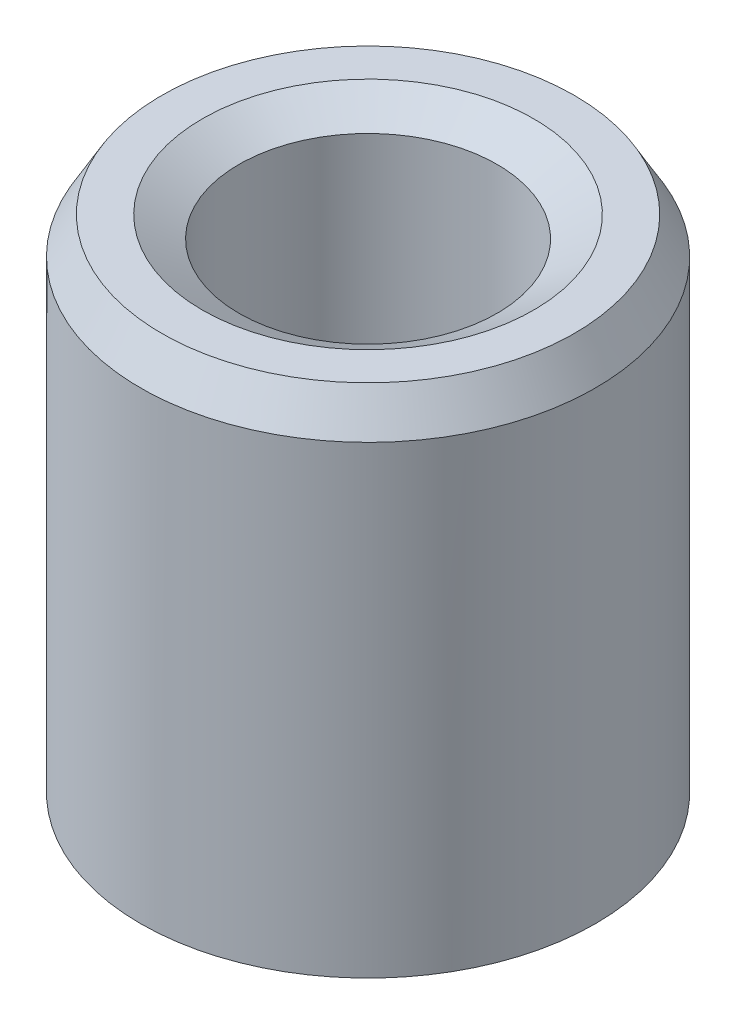
ISO-10303-21;
HEADER;
FILE_DESCRIPTION(('STEP AP214'),'2;1');
FILE_NAME('part.step','',(''),(''),'','','');
FILE_SCHEMA(('AUTOMOTIVE_DESIGN { 1 0 10303 214 1 1 1 1 }'));
ENDSEC;
DATA;
#1=APPLICATION_CONTEXT('core data for automotive mechanical design processes');
#2=APPLICATION_PROTOCOL_DEFINITION('international standard','automotive_design',2000,#1);
#3=PRODUCT_CONTEXT('',#1,'mechanical');
#4=PRODUCT('Part','Part','',(#3));
#5=PRODUCT_RELATED_PRODUCT_CATEGORY('part','',(#4));
#6=PRODUCT_DEFINITION_FORMATION('','',#4);
#7=PRODUCT_DEFINITION_CONTEXT('part definition',#1,'design');
#8=PRODUCT_DEFINITION('design','',#6,#7);
#9=PRODUCT_DEFINITION_SHAPE('','',#8);
#10=(LENGTH_UNIT() NAMED_UNIT(*) SI_UNIT(.MILLI.,.METRE.));
#11=(NAMED_UNIT(*) PLANE_ANGLE_UNIT() SI_UNIT($,.RADIAN.));
#12=(NAMED_UNIT(*) SI_UNIT($,.STERADIAN.) SOLID_ANGLE_UNIT());
#13=UNCERTAINTY_MEASURE_WITH_UNIT(LENGTH_MEASURE(1.E-05),#10,'distance_accuracy_value','');
#14=(GEOMETRIC_REPRESENTATION_CONTEXT(3) GLOBAL_UNCERTAINTY_ASSIGNED_CONTEXT((#13)) GLOBAL_UNIT_ASSIGNED_CONTEXT((#10,
#11,#12)) REPRESENTATION_CONTEXT('',''));
#15=CARTESIAN_POINT('',(0.,0.,0.));
#16=DIRECTION('',(0.,0.,1.));
#17=DIRECTION('',(1.,0.,0.));
#18=AXIS2_PLACEMENT_3D('',#15,#16,#17);
#19=CARTESIAN_POINT('',(0.,40.1490923998968,0.));
#20=DIRECTION('',(0.,-1.,0.));
#21=DIRECTION('',(0.,0.,-1.));
#22=AXIS2_PLACEMENT_3D('',#19,#20,#21);
#23=CYLINDRICAL_SURFACE('',#22,17.5);
#24=CARTESIAN_POINT('',(0.,1.62802650822279,0.));
#25=DIRECTION('',(0.,1.,0.));
#26=DIRECTION('',(0.,0.,1.));
#27=AXIS2_PLACEMENT_3D('',#24,#25,#26);
#28=CIRCLE('',#27,17.5);
#29=CARTESIAN_POINT('',(0.,1.62802650822279,17.5));
#30=VERTEX_POINT('',#29);
#31=EDGE_CURVE('E10',#30,#30,#28,.T.);
#32=ORIENTED_EDGE('',*,*,#31,.T.);
#33=EDGE_LOOP('',(#32));
#34=FACE_BOUND('',#33,.T.);
#35=CARTESIAN_POINT('',(0.,37.329267771586,0.));
#36=DIRECTION('',(0.,1.,0.));
#37=DIRECTION('',(0.,0.,1.));
#38=AXIS2_PLACEMENT_3D('',#35,#36,#37);
#39=CIRCLE('',#38,17.5);
#40=CARTESIAN_POINT('',(0.,37.329267771586,-17.5));
#41=VERTEX_POINT('',#40);
#42=EDGE_CURVE('E50',#41,#41,#39,.F.);
#43=ORIENTED_EDGE('',*,*,#42,.T.);
#44=EDGE_LOOP('',(#43));
#45=FACE_BOUND('',#44,.T.);
#46=ADVANCED_FACE('F39',(#34,#45),#23,.T.);
#47=CARTESIAN_POINT('',(0.,40.1490923998968,0.));
#48=DIRECTION('',(0.,1.,0.));
#49=DIRECTION('',(0.,0.,1.));
#50=AXIS2_PLACEMENT_3D('',#47,#48,#49);
#51=PLANE('',#50);
#52=CARTESIAN_POINT('',(0.,40.1490923998968,0.));
#53=DIRECTION('',(0.,1.,0.));
#54=DIRECTION('',(0.,0.,1.));
#55=AXIS2_PLACEMENT_3D('',#52,#53,#54);
#56=CIRCLE('',#55,12.7515358116653);
#57=CARTESIAN_POINT('',(0.,40.1490923998968,12.7515358116653));
#58=VERTEX_POINT('',#57);
#59=EDGE_CURVE('E58',#58,#58,#56,.F.);
#60=ORIENTED_EDGE('',*,*,#59,.T.);
#61=EDGE_LOOP('',(#60));
#62=FACE_BOUND('',#61,.T.);
#63=CARTESIAN_POINT('',(0.,40.1490923998968,0.));
#64=DIRECTION('',(0.,1.,0.));
#65=DIRECTION('',(0.,0.,1.));
#66=AXIS2_PLACEMENT_3D('',#63,#64,#65);
#67=CIRCLE('',#66,15.8719734917772);
#68=CARTESIAN_POINT('',(0.,40.1490923998968,-15.8719734917772));
#69=VERTEX_POINT('',#68);
#70=EDGE_CURVE('E61',#69,#69,#67,.T.);
#71=ORIENTED_EDGE('',*,*,#70,.T.);
#72=EDGE_LOOP('',(#71));
#73=FACE_BOUND('',#72,.T.);
#74=ADVANCED_FACE('F88',(#62,#73),#51,.T.);
#75=CARTESIAN_POINT('',(0.,0.,0.));
#76=DIRECTION('',(0.,1.,0.));
#77=DIRECTION('',(0.,0.,1.));
#78=AXIS2_PLACEMENT_3D('',#75,#76,#77);
#79=PLANE('',#78);
#80=CARTESIAN_POINT('',(0.,0.,0.));
#81=DIRECTION('',(0.,1.,0.));
#82=DIRECTION('',(0.,0.,1.));
#83=AXIS2_PLACEMENT_3D('',#80,#81,#82);
#84=CIRCLE('',#83,11.5597376915772);
#85=CARTESIAN_POINT('',(0.,0.,11.5597376915772));
#86=VERTEX_POINT('',#85);
#87=EDGE_CURVE('E51',#86,#86,#84,.T.);
#88=ORIENTED_EDGE('',*,*,#87,.T.);
#89=EDGE_LOOP('',(#88));
#90=FACE_BOUND('',#89,.T.);
#91=CARTESIAN_POINT('',(0.,0.,0.));
#92=DIRECTION('',(0.,1.,0.));
#93=DIRECTION('',(0.,0.,1.));
#94=AXIS2_PLACEMENT_3D('',#91,#92,#93);
#95=CIRCLE('',#94,14.6801753716892);
#96=CARTESIAN_POINT('',(0.,0.,14.6801753716892));
#97=VERTEX_POINT('',#96);
#98=EDGE_CURVE('E54',#97,#97,#95,.F.);
#99=ORIENTED_EDGE('',*,*,#98,.T.);
#100=EDGE_LOOP('',(#99));
#101=FACE_BOUND('',#100,.T.);
#102=ADVANCED_FACE('F83',(#90,#101),#79,.F.);
#103=CARTESIAN_POINT('',(0.,40.1490923998968,0.));
#104=DIRECTION('',(0.,-1.,0.));
#105=DIRECTION('',(0.,0.,-1.));
#106=AXIS2_PLACEMENT_3D('',#103,#104,#105);
#107=CYLINDRICAL_SURFACE('',#106,9.93171118335442);
#108=CARTESIAN_POINT('',(0.,38.5210658916741,0.));
#109=DIRECTION('',(0.,1.,0.));
#110=DIRECTION('',(0.,0.,1.));
#111=AXIS2_PLACEMENT_3D('',#108,#109,#110);
#112=CIRCLE('',#111,9.93171118335442);
#113=CARTESIAN_POINT('',(0.,38.5210658916741,9.93171118335442));
#114=VERTEX_POINT('',#113);
#115=EDGE_CURVE('E67',#114,#114,#112,.T.);
#116=ORIENTED_EDGE('',*,*,#115,.T.);
#117=EDGE_LOOP('',(#116));
#118=FACE_BOUND('',#117,.T.);
#119=CARTESIAN_POINT('',(0.,2.81982462831086,0.));
#120=DIRECTION('',(0.,1.,0.));
#121=DIRECTION('',(0.,0.,1.));
#122=AXIS2_PLACEMENT_3D('',#119,#120,#121);
#123=CIRCLE('',#122,9.93171118335442);
#124=CARTESIAN_POINT('',(0.,2.81982462831086,9.93171118335442));
#125=VERTEX_POINT('',#124);
#126=EDGE_CURVE('E69',#125,#125,#123,.F.);
#127=ORIENTED_EDGE('',*,*,#126,.T.);
#128=EDGE_LOOP('',(#127));
#129=FACE_BOUND('',#128,.T.);
#130=ADVANCED_FACE('F71',(#118,#129),#107,.F.);
#131=CARTESIAN_POINT('',(0.,38.5210658916741,0.));
#132=DIRECTION('',(0.,1.,0.));
#133=DIRECTION('',(0.,0.,1.));
#134=AXIS2_PLACEMENT_3D('',#131,#132,#133);
#135=CONICAL_SURFACE('',#134,9.93171118335442,1.0471975511966);
#136=ORIENTED_EDGE('',*,*,#59,.F.);
#137=EDGE_LOOP('',(#136));
#138=FACE_BOUND('',#137,.T.);
#139=ORIENTED_EDGE('',*,*,#115,.F.);
#140=EDGE_LOOP('',(#139));
#141=FACE_BOUND('',#140,.T.);
#142=ADVANCED_FACE('F77',(#138,#141),#135,.F.);
#143=CARTESIAN_POINT('',(0.,0.,0.));
#144=DIRECTION('',(0.,-1.,0.));
#145=DIRECTION('',(0.,0.,-1.));
#146=AXIS2_PLACEMENT_3D('',#143,#144,#145);
#147=CONICAL_SURFACE('',#146,11.5597376915772,0.523598775598295);
#148=ORIENTED_EDGE('',*,*,#126,.F.);
#149=EDGE_LOOP('',(#148));
#150=FACE_BOUND('',#149,.T.);
#151=ORIENTED_EDGE('',*,*,#87,.F.);
#152=EDGE_LOOP('',(#151));
#153=FACE_BOUND('',#152,.T.);
#154=ADVANCED_FACE('F73',(#150,#153),#147,.F.);
#155=CARTESIAN_POINT('',(0.,1.62802650822279,0.));
#156=DIRECTION('',(0.,1.,0.));
#157=DIRECTION('',(0.,0.,1.));
#158=AXIS2_PLACEMENT_3D('',#155,#156,#157);
#159=CONICAL_SURFACE('',#158,17.5,1.0471975511966);
#160=ORIENTED_EDGE('',*,*,#98,.F.);
#161=EDGE_LOOP('',(#160));
#162=FACE_BOUND('',#161,.T.);
#163=ORIENTED_EDGE('',*,*,#31,.F.);
#164=EDGE_LOOP('',(#163));
#165=FACE_BOUND('',#164,.T.);
#166=ADVANCED_FACE('F76',(#162,#165),#159,.T.);
#167=CARTESIAN_POINT('',(0.,40.1490923998968,0.));
#168=DIRECTION('',(0.,-1.,0.));
#169=DIRECTION('',(0.,0.,-1.));
#170=AXIS2_PLACEMENT_3D('',#167,#168,#169);
#171=CONICAL_SURFACE('',#170,15.8719734917772,0.523598775598298);
#172=CARTESIAN_POINT('',(0.,37.329267771586,-17.5));
#173=CARTESIAN_POINT('',(0.,37.3586409447976,-17.4830413905394));
#174=CARTESIAN_POINT('',(0.,37.3880141180092,-17.4660827810787));
#175=CARTESIAN_POINT('',(0.,37.4467604644323,-17.4321655621574));
#176=CARTESIAN_POINT('',(0.,37.4761336376439,-17.4152069526967));
#177=CARTESIAN_POINT('',(0.,37.534879984067,-17.3812897337754));
#178=CARTESIAN_POINT('',(0.,37.5642531572786,-17.3643311243148));
#179=CARTESIAN_POINT('',(0.,37.6229995037017,-17.3304139053935));
#180=CARTESIAN_POINT('',(0.,37.6523726769133,-17.3134552959328));
#181=CARTESIAN_POINT('',(0.,37.7111190233364,-17.2795380770115));
#182=CARTESIAN_POINT('',(0.,37.740492196548,-17.2625794675509));
#183=CARTESIAN_POINT('',(0.,37.7992385429712,-17.2286622486295));
#184=CARTESIAN_POINT('',(0.,37.8286117161827,-17.2117036391689));
#185=CARTESIAN_POINT('',(0.,37.8873580626059,-17.1777864202476));
#186=CARTESIAN_POINT('',(0.,37.9167312358174,-17.1608278107869));
#187=CARTESIAN_POINT('',(0.,37.9754775822406,-17.1269105918656));
#188=CARTESIAN_POINT('',(0.,38.0048507554522,-17.109951982405));
#189=CARTESIAN_POINT('',(0.,38.0635971018753,-17.0760347634837));
#190=CARTESIAN_POINT('',(0.,38.0929702750869,-17.059076154023));
#191=CARTESIAN_POINT('',(0.,38.15171662151,-17.0251589351017));
#192=CARTESIAN_POINT('',(0.,38.1810897947216,-17.008200325641));
#193=CARTESIAN_POINT('',(0.,38.2398361411447,-16.9742831067197));
#194=CARTESIAN_POINT('',(0.,38.2692093143563,-16.9573244972591));
#195=CARTESIAN_POINT('',(0.,38.3279556607794,-16.9234072783378));
#196=CARTESIAN_POINT('',(0.,38.357328833991,-16.9064486688771));
#197=CARTESIAN_POINT('',(0.,38.4160751804141,-16.8725314499558));
#198=CARTESIAN_POINT('',(0.,38.4454483536257,-16.8555728404952));
#199=CARTESIAN_POINT('',(0.,38.5041947000489,-16.8216556215738));
#200=CARTESIAN_POINT('',(0.,38.5335678732604,-16.8046970121132));
#201=CARTESIAN_POINT('',(0.,38.5923142196836,-16.7707797931919));
#202=CARTESIAN_POINT('',(0.,38.6216873928951,-16.7538211837312));
#203=CARTESIAN_POINT('',(0.,38.6804337393183,-16.7199039648099));
#204=CARTESIAN_POINT('',(0.,38.7098069125299,-16.7029453553493));
#205=CARTESIAN_POINT('',(0.,38.768553258953,-16.669028136428));
#206=CARTESIAN_POINT('',(0.,38.7979264321646,-16.6520695269673));
#207=CARTESIAN_POINT('',(0.,38.8566727785877,-16.618152308046));
#208=CARTESIAN_POINT('',(0.,38.8860459517993,-16.6011936985853));
#209=CARTESIAN_POINT('',(0.,38.9447922982224,-16.567276479664));
#210=CARTESIAN_POINT('',(0.,38.974165471434,-16.5503178702034));
#211=CARTESIAN_POINT('',(0.,39.0329118178571,-16.5164006512821));
#212=CARTESIAN_POINT('',(0.,39.0622849910687,-16.4994420418214));
#213=CARTESIAN_POINT('',(0.,39.1210313374919,-16.4655248229001));
#214=CARTESIAN_POINT('',(0.,39.1504045107034,-16.4485662134395));
#215=CARTESIAN_POINT('',(0.,39.2091508571266,-16.4146489945181));
#216=CARTESIAN_POINT('',(0.,39.2385240303381,-16.3976903850575));
#217=CARTESIAN_POINT('',(0.,39.2972703767613,-16.3637731661362));
#218=CARTESIAN_POINT('',(0.,39.3266435499729,-16.3468145566755));
#219=CARTESIAN_POINT('',(0.,39.385389896396,-16.3128973377542));
#220=CARTESIAN_POINT('',(0.,39.4147630696076,-16.2959387282936));
#221=CARTESIAN_POINT('',(0.,39.4735094160307,-16.2620215093723));
#222=CARTESIAN_POINT('',(0.,39.5028825892423,-16.2450628999116));
#223=CARTESIAN_POINT('',(0.,39.5616289356654,-16.2111456809903));
#224=CARTESIAN_POINT('',(0.,39.591002108877,-16.1941870715296));
#225=CARTESIAN_POINT('',(0.,39.6497484553001,-16.1602698526083));
#226=CARTESIAN_POINT('',(0.,39.6791216285117,-16.1433112431477));
#227=CARTESIAN_POINT('',(0.,39.7378679749348,-16.1093940242264));
#228=CARTESIAN_POINT('',(0.,39.7672411481464,-16.0924354147657));
#229=CARTESIAN_POINT('',(0.,39.8259874945696,-16.0585181958444));
#230=CARTESIAN_POINT('',(0.,39.8553606677811,-16.0415595863838));
#231=CARTESIAN_POINT('',(0.,39.9141070142043,-16.0076423674625));
#232=CARTESIAN_POINT('',(0.,39.9434801874158,-15.9906837580018));
#233=CARTESIAN_POINT('',(0.,40.002226533839,-15.9567665390805));
#234=CARTESIAN_POINT('',(0.,40.0315997070506,-15.9398079296198));
#235=CARTESIAN_POINT('',(0.,40.0903460534737,-15.9058907106985));
#236=CARTESIAN_POINT('',(0.,40.1197192266853,-15.8889321012379));
#237=CARTESIAN_POINT('',(0.,40.1490923998968,-15.8719734917772));
#238=B_SPLINE_CURVE_WITH_KNOTS('',3,(#172,#173,#174,#175,#176,#177,#178,#179,#180,#181,#182,
#183,#184,#185,#186,#187,#188,#189,#190,#191,#192,#193,#194,#195,#196,#197,#198,#199,#200,#201,
#202,#203,#204,#205,#206,#207,#208,#209,#210,#211,#212,#213,#214,#215,#216,#217,#218,#219,#220,
#221,#222,#223,#224,#225,#226,#227,#228,#229,#230,#231,#232,#233,#234,#235,#236,#237),
.UNSPECIFIED.,.F.,.F.,(4,2,2,2,2,2,2,2,2,2,2,2,2,2,2,2,2,2,2,2,2,2,2,2,2,2,2,2,2,2,2,2,4),(0.,
0.10175165676392,0.203503313527846,0.305254970291772,0.407006627055698,0.508758283819618,
0.610509940583544,0.712261597347468,0.814013254111394,0.915764910875314,1.01751656763924,
1.11926822440317,1.22101988116709,1.32277153793101,1.42452319469494,1.52627485145886,
1.62802650822279,1.72977816498671,1.83152982175063,1.93328147851456,2.03503313527848,
2.1367847920424,2.23853644880633,2.34028810557026,2.44203976233418,2.5437914190981,
2.64554307586203,2.74729473262595,2.84904638938988,2.9507980461538,3.05254970291772,
3.15430135968165,3.25605301644557),.UNSPECIFIED.);
#239=EDGE_CURVE('BSEAM45',#41,#69,#238,.T.);
#240=ORIENTED_EDGE('',*,*,#42,.F.);
#241=ORIENTED_EDGE('',*,*,#70,.F.);
#242=ORIENTED_EDGE('',*,*,#239,.T.);
#243=ORIENTED_EDGE('',*,*,#239,.F.);
#244=EDGE_LOOP('',(#240,#242,#241,#243));
#245=FACE_BOUND('',#244,.T.);
#246=ADVANCED_FACE('F45',(#245),#171,.T.);
#247=CLOSED_SHELL('',(#46,#74,#102,#130,#142,#154,#166,#246));
#248=MANIFOLD_SOLID_BREP('B2',#247);
#249=ADVANCED_BREP_SHAPE_REPRESENTATION('',(#18,#248),#14);
#250=SHAPE_DEFINITION_REPRESENTATION(#9,#249);
ENDSEC;
END-ISO-10303-21;
